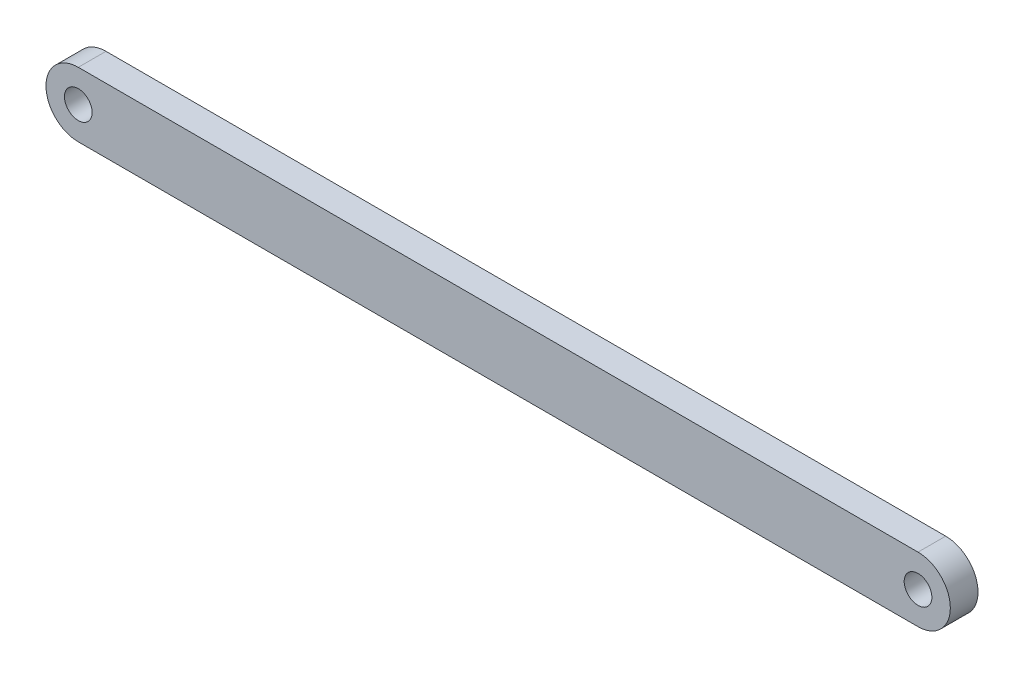
ISO-10303-21;
HEADER;
FILE_DESCRIPTION(('STEP AP214'),'2;1');
FILE_NAME('part.step','',(''),(''),'','','');
FILE_SCHEMA(('AUTOMOTIVE_DESIGN { 1 0 10303 214 1 1 1 1 }'));
ENDSEC;
DATA;
#1=APPLICATION_CONTEXT('core data for automotive mechanical design processes');
#2=APPLICATION_PROTOCOL_DEFINITION('international standard','automotive_design',2000,#1);
#3=PRODUCT_CONTEXT('',#1,'mechanical');
#4=PRODUCT('Part','Part','',(#3));
#5=PRODUCT_RELATED_PRODUCT_CATEGORY('part','',(#4));
#6=PRODUCT_DEFINITION_FORMATION('','',#4);
#7=PRODUCT_DEFINITION_CONTEXT('part definition',#1,'design');
#8=PRODUCT_DEFINITION('design','',#6,#7);
#9=PRODUCT_DEFINITION_SHAPE('','',#8);
#10=(LENGTH_UNIT() NAMED_UNIT(*) SI_UNIT(.MILLI.,.METRE.));
#11=(NAMED_UNIT(*) PLANE_ANGLE_UNIT() SI_UNIT($,.RADIAN.));
#12=(NAMED_UNIT(*) SI_UNIT($,.STERADIAN.) SOLID_ANGLE_UNIT());
#13=UNCERTAINTY_MEASURE_WITH_UNIT(LENGTH_MEASURE(1.E-05),#10,'distance_accuracy_value','');
#14=(GEOMETRIC_REPRESENTATION_CONTEXT(3) GLOBAL_UNCERTAINTY_ASSIGNED_CONTEXT((#13)) GLOBAL_UNIT_ASSIGNED_CONTEXT((#10,
#11,#12)) REPRESENTATION_CONTEXT('',''));
#15=CARTESIAN_POINT('',(0.,0.,0.));
#16=DIRECTION('',(0.,0.,1.));
#17=DIRECTION('',(1.,0.,0.));
#18=AXIS2_PLACEMENT_3D('',#15,#16,#17);
#19=CARTESIAN_POINT('',(0.,0.,6.));
#20=DIRECTION('',(0.,0.,1.));
#21=DIRECTION('',(1.,0.,0.));
#22=AXIS2_PLACEMENT_3D('',#19,#20,#21);
#23=PLANE('',#22);
#24=CARTESIAN_POINT('',(0.,0.,6.));
#25=DIRECTION('',(0.,0.,1.));
#26=DIRECTION('',(1.,0.,0.));
#27=AXIS2_PLACEMENT_3D('',#24,#25,#26);
#28=CIRCLE('',#27,3.);
#29=CARTESIAN_POINT('',(3.,0.,6.));
#30=VERTEX_POINT('',#29);
#31=EDGE_CURVE('E101',#30,#30,#28,.T.);
#32=ORIENTED_EDGE('',*,*,#31,.F.);
#33=EDGE_LOOP('',(#32));
#34=FACE_BOUND('',#33,.T.);
#35=CARTESIAN_POINT('',(0.,0.,6.));
#36=DIRECTION('',(0.,0.,1.));
#37=DIRECTION('',(1.,0.,0.));
#38=AXIS2_PLACEMENT_3D('',#35,#36,#37);
#39=CIRCLE('',#38,7.);
#40=CARTESIAN_POINT('',(0.,7.,6.));
#41=VERTEX_POINT('',#40);
#42=CARTESIAN_POINT('',(0.,-7.,6.));
#43=VERTEX_POINT('',#42);
#44=EDGE_CURVE('E86',#41,#43,#39,.T.);
#45=ORIENTED_EDGE('',*,*,#44,.T.);
#46=DIRECTION('',(1.,0.,0.));
#47=VECTOR('',#46,1.);
#48=CARTESIAN_POINT('',(0.,-7.,6.));
#49=LINE('',#48,#47);
#50=CARTESIAN_POINT('',(182.,-7.,6.));
#51=VERTEX_POINT('',#50);
#52=EDGE_CURVE('E81',#43,#51,#49,.T.);
#53=ORIENTED_EDGE('',*,*,#52,.T.);
#54=CARTESIAN_POINT('',(182.,0.,6.));
#55=DIRECTION('',(0.,0.,1.));
#56=DIRECTION('',(1.,0.,0.));
#57=AXIS2_PLACEMENT_3D('',#54,#55,#56);
#58=CIRCLE('',#57,7.);
#59=CARTESIAN_POINT('',(182.,7.00000000000003,6.));
#60=VERTEX_POINT('',#59);
#61=EDGE_CURVE('E84',#51,#60,#58,.T.);
#62=ORIENTED_EDGE('',*,*,#61,.T.);
#63=DIRECTION('',(-1.,0.,0.));
#64=VECTOR('',#63,1.);
#65=CARTESIAN_POINT('',(0.,7.,6.));
#66=LINE('',#65,#64);
#67=EDGE_CURVE('E51',#60,#41,#66,.T.);
#68=ORIENTED_EDGE('',*,*,#67,.T.);
#69=EDGE_LOOP('',(#45,#53,#62,#68));
#70=FACE_BOUND('',#69,.T.);
#71=CARTESIAN_POINT('',(182.,0.,6.));
#72=DIRECTION('',(0.,0.,1.));
#73=DIRECTION('',(1.,0.,0.));
#74=AXIS2_PLACEMENT_3D('',#71,#72,#73);
#75=CIRCLE('',#74,2.99999999999999);
#76=CARTESIAN_POINT('',(185.,0.,6.));
#77=VERTEX_POINT('',#76);
#78=EDGE_CURVE('E116',#77,#77,#75,.T.);
#79=ORIENTED_EDGE('',*,*,#78,.F.);
#80=EDGE_LOOP('',(#79));
#81=FACE_BOUND('',#80,.T.);
#82=ADVANCED_FACE('F34',(#34,#70,#81),#23,.T.);
#83=CARTESIAN_POINT('',(0.,0.,0.));
#84=DIRECTION('',(0.,0.,1.));
#85=DIRECTION('',(1.,0.,0.));
#86=AXIS2_PLACEMENT_3D('',#83,#84,#85);
#87=PLANE('',#86);
#88=CARTESIAN_POINT('',(0.,0.,0.));
#89=DIRECTION('',(0.,0.,1.));
#90=DIRECTION('',(1.,0.,0.));
#91=AXIS2_PLACEMENT_3D('',#88,#89,#90);
#92=CIRCLE('',#91,7.);
#93=CARTESIAN_POINT('',(0.,7.,0.));
#94=VERTEX_POINT('',#93);
#95=CARTESIAN_POINT('',(0.,-7.,0.));
#96=VERTEX_POINT('',#95);
#97=EDGE_CURVE('E98',#94,#96,#92,.T.);
#98=ORIENTED_EDGE('',*,*,#97,.F.);
#99=DIRECTION('',(-1.,0.,0.));
#100=VECTOR('',#99,1.);
#101=CARTESIAN_POINT('',(0.,7.,0.));
#102=LINE('',#101,#100);
#103=CARTESIAN_POINT('',(182.,7.00000000000003,0.));
#104=VERTEX_POINT('',#103);
#105=EDGE_CURVE('E74',#104,#94,#102,.T.);
#106=ORIENTED_EDGE('',*,*,#105,.F.);
#107=CARTESIAN_POINT('',(182.,0.,0.));
#108=DIRECTION('',(0.,0.,1.));
#109=DIRECTION('',(1.,0.,0.));
#110=AXIS2_PLACEMENT_3D('',#107,#108,#109);
#111=CIRCLE('',#110,7.);
#112=CARTESIAN_POINT('',(182.,-7.,0.));
#113=VERTEX_POINT('',#112);
#114=EDGE_CURVE('E68',#113,#104,#111,.T.);
#115=ORIENTED_EDGE('',*,*,#114,.F.);
#116=DIRECTION('',(1.,0.,0.));
#117=VECTOR('',#116,1.);
#118=CARTESIAN_POINT('',(0.,-7.,0.));
#119=LINE('',#118,#117);
#120=EDGE_CURVE('E90',#96,#113,#119,.T.);
#121=ORIENTED_EDGE('',*,*,#120,.F.);
#122=EDGE_LOOP('',(#98,#106,#115,#121));
#123=FACE_BOUND('',#122,.T.);
#124=CARTESIAN_POINT('',(0.,0.,0.));
#125=DIRECTION('',(0.,0.,1.));
#126=DIRECTION('',(1.,0.,0.));
#127=AXIS2_PLACEMENT_3D('',#124,#125,#126);
#128=CIRCLE('',#127,3.);
#129=CARTESIAN_POINT('',(3.,0.,0.));
#130=VERTEX_POINT('',#129);
#131=EDGE_CURVE('E113',#130,#130,#128,.T.);
#132=ORIENTED_EDGE('',*,*,#131,.T.);
#133=EDGE_LOOP('',(#132));
#134=FACE_BOUND('',#133,.T.);
#135=CARTESIAN_POINT('',(182.,0.,0.));
#136=DIRECTION('',(0.,0.,1.));
#137=DIRECTION('',(1.,0.,0.));
#138=AXIS2_PLACEMENT_3D('',#135,#136,#137);
#139=CIRCLE('',#138,2.99999999999999);
#140=CARTESIAN_POINT('',(185.,0.,0.));
#141=VERTEX_POINT('',#140);
#142=EDGE_CURVE('E119',#141,#141,#139,.T.);
#143=ORIENTED_EDGE('',*,*,#142,.T.);
#144=EDGE_LOOP('',(#143));
#145=FACE_BOUND('',#144,.T.);
#146=ADVANCED_FACE('F109',(#123,#134,#145),#87,.F.);
#147=CARTESIAN_POINT('',(0.,0.,6.));
#148=DIRECTION('',(0.,0.,-1.));
#149=DIRECTION('',(-1.,0.,0.));
#150=AXIS2_PLACEMENT_3D('',#147,#148,#149);
#151=CYLINDRICAL_SURFACE('',#150,7.);
#152=ORIENTED_EDGE('',*,*,#97,.T.);
#153=DIRECTION('',(0.,0.,-1.));
#154=VECTOR('',#153,1.);
#155=CARTESIAN_POINT('',(0.,-7.,6.));
#156=LINE('',#155,#154);
#157=EDGE_CURVE('E11',#43,#96,#156,.T.);
#158=ORIENTED_EDGE('',*,*,#157,.F.);
#159=ORIENTED_EDGE('',*,*,#44,.F.);
#160=DIRECTION('',(0.,0.,-1.));
#161=VECTOR('',#160,1.);
#162=CARTESIAN_POINT('',(0.,7.,6.));
#163=LINE('',#162,#161);
#164=EDGE_CURVE('E94',#41,#94,#163,.T.);
#165=ORIENTED_EDGE('',*,*,#164,.T.);
#166=EDGE_LOOP('',(#152,#158,#159,#165));
#167=FACE_BOUND('',#166,.T.);
#168=ADVANCED_FACE('F36',(#167),#151,.T.);
#169=CARTESIAN_POINT('',(0.,-7.,6.));
#170=DIRECTION('',(0.,1.,0.));
#171=DIRECTION('',(-1.,0.,0.));
#172=AXIS2_PLACEMENT_3D('',#169,#170,#171);
#173=PLANE('',#172);
#174=ORIENTED_EDGE('',*,*,#120,.T.);
#175=DIRECTION('',(0.,0.,-1.));
#176=VECTOR('',#175,1.);
#177=CARTESIAN_POINT('',(182.,-7.,6.));
#178=LINE('',#177,#176);
#179=EDGE_CURVE('E43',#51,#113,#178,.T.);
#180=ORIENTED_EDGE('',*,*,#179,.F.);
#181=ORIENTED_EDGE('',*,*,#52,.F.);
#182=ORIENTED_EDGE('',*,*,#157,.T.);
#183=EDGE_LOOP('',(#174,#180,#181,#182));
#184=FACE_BOUND('',#183,.T.);
#185=ADVANCED_FACE('F89',(#184),#173,.F.);
#186=CARTESIAN_POINT('',(182.,0.,6.));
#187=DIRECTION('',(0.,0.,-1.));
#188=DIRECTION('',(-1.,0.,0.));
#189=AXIS2_PLACEMENT_3D('',#186,#187,#188);
#190=CYLINDRICAL_SURFACE('',#189,7.);
#191=ORIENTED_EDGE('',*,*,#114,.T.);
#192=DIRECTION('',(0.,0.,-1.));
#193=VECTOR('',#192,1.);
#194=CARTESIAN_POINT('',(182.,7.00000000000003,6.));
#195=LINE('',#194,#193);
#196=EDGE_CURVE('E91',#60,#104,#195,.T.);
#197=ORIENTED_EDGE('',*,*,#196,.F.);
#198=ORIENTED_EDGE('',*,*,#61,.F.);
#199=ORIENTED_EDGE('',*,*,#179,.T.);
#200=EDGE_LOOP('',(#191,#197,#198,#199));
#201=FACE_BOUND('',#200,.T.);
#202=ADVANCED_FACE('F92',(#201),#190,.T.);
#203=CARTESIAN_POINT('',(0.,7.,6.));
#204=DIRECTION('',(0.,-1.,0.));
#205=DIRECTION('',(1.,0.,0.));
#206=AXIS2_PLACEMENT_3D('',#203,#204,#205);
#207=PLANE('',#206);
#208=ORIENTED_EDGE('',*,*,#105,.T.);
#209=ORIENTED_EDGE('',*,*,#164,.F.);
#210=ORIENTED_EDGE('',*,*,#67,.F.);
#211=ORIENTED_EDGE('',*,*,#196,.T.);
#212=EDGE_LOOP('',(#208,#209,#210,#211));
#213=FACE_BOUND('',#212,.T.);
#214=ADVANCED_FACE('F106',(#213),#207,.F.);
#215=CARTESIAN_POINT('',(0.,0.,6.));
#216=DIRECTION('',(0.,0.,-1.));
#217=DIRECTION('',(-1.,0.,0.));
#218=AXIS2_PLACEMENT_3D('',#215,#216,#217);
#219=CYLINDRICAL_SURFACE('',#218,3.);
#220=ORIENTED_EDGE('',*,*,#31,.T.);
#221=EDGE_LOOP('',(#220));
#222=FACE_BOUND('',#221,.T.);
#223=ORIENTED_EDGE('',*,*,#131,.F.);
#224=EDGE_LOOP('',(#223));
#225=FACE_BOUND('',#224,.T.);
#226=ADVANCED_FACE('F136',(#222,#225),#219,.F.);
#227=CARTESIAN_POINT('',(182.,0.,6.));
#228=DIRECTION('',(0.,0.,-1.));
#229=DIRECTION('',(-1.,0.,0.));
#230=AXIS2_PLACEMENT_3D('',#227,#228,#229);
#231=CYLINDRICAL_SURFACE('',#230,2.99999999999999);
#232=ORIENTED_EDGE('',*,*,#78,.T.);
#233=EDGE_LOOP('',(#232));
#234=FACE_BOUND('',#233,.T.);
#235=ORIENTED_EDGE('',*,*,#142,.F.);
#236=EDGE_LOOP('',(#235));
#237=FACE_BOUND('',#236,.T.);
#238=ADVANCED_FACE('F125',(#234,#237),#231,.F.);
#239=CLOSED_SHELL('',(#82,#146,#168,#185,#202,#214,#226,#238));
#240=MANIFOLD_SOLID_BREP('B2',#239);
#241=ADVANCED_BREP_SHAPE_REPRESENTATION('',(#18,#240),#14);
#242=SHAPE_DEFINITION_REPRESENTATION(#9,#241);
ENDSEC;
END-ISO-10303-21;
